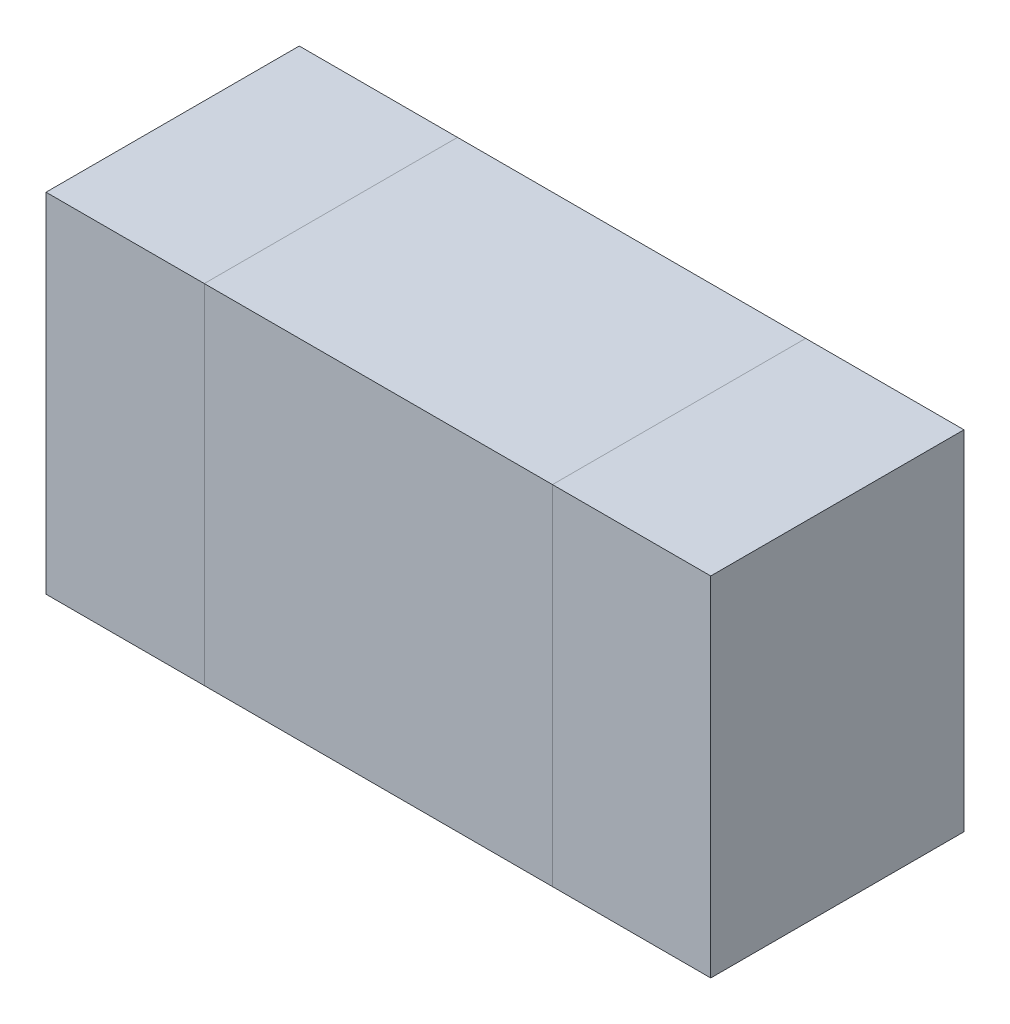
ISO-10303-21;
HEADER;
FILE_DESCRIPTION(('STEP AP214'),'2;1');
FILE_NAME('part.step','',(''),(''),'','','');
FILE_SCHEMA(('AUTOMOTIVE_DESIGN { 1 0 10303 214 1 1 1 1 }'));
ENDSEC;
DATA;
#1=APPLICATION_CONTEXT('core data for automotive mechanical design processes');
#2=APPLICATION_PROTOCOL_DEFINITION('international standard','automotive_design',2000,#1);
#3=PRODUCT_CONTEXT('',#1,'mechanical');
#4=PRODUCT('Part','Part','',(#3));
#5=PRODUCT_RELATED_PRODUCT_CATEGORY('part','',(#4));
#6=PRODUCT_DEFINITION_FORMATION('','',#4);
#7=PRODUCT_DEFINITION_CONTEXT('part definition',#1,'design');
#8=PRODUCT_DEFINITION('design','',#6,#7);
#9=PRODUCT_DEFINITION_SHAPE('','',#8);
#10=(LENGTH_UNIT() NAMED_UNIT(*) SI_UNIT(.MILLI.,.METRE.));
#11=(NAMED_UNIT(*) PLANE_ANGLE_UNIT() SI_UNIT($,.RADIAN.));
#12=(NAMED_UNIT(*) SI_UNIT($,.STERADIAN.) SOLID_ANGLE_UNIT());
#13=UNCERTAINTY_MEASURE_WITH_UNIT(LENGTH_MEASURE(1.E-05),#10,'distance_accuracy_value','');
#14=(GEOMETRIC_REPRESENTATION_CONTEXT(3) GLOBAL_UNCERTAINTY_ASSIGNED_CONTEXT((#13)) GLOBAL_UNIT_ASSIGNED_CONTEXT((#10,
#11,#12)) REPRESENTATION_CONTEXT('',''));
#15=CARTESIAN_POINT('',(0.,0.,0.));
#16=DIRECTION('',(0.,0.,1.));
#17=DIRECTION('',(1.,0.,0.));
#18=AXIS2_PLACEMENT_3D('',#15,#16,#17);
#19=CARTESIAN_POINT('',(-0.27500072,0.27500072,0.));
#20=DIRECTION('',(1.,0.,0.));
#21=DIRECTION('',(0.,-1.,0.));
#22=AXIS2_PLACEMENT_3D('',#19,#20,#21);
#23=PLANE('',#22);
#24=DIRECTION('',(0.,-1.,0.));
#25=VECTOR('',#24,1.);
#26=CARTESIAN_POINT('',(-0.27500072,0.27500072,0.));
#27=LINE('',#26,#25);
#28=CARTESIAN_POINT('',(-0.27500072,0.27500072,0.));
#29=VERTEX_POINT('',#28);
#30=CARTESIAN_POINT('',(-0.27500072,-0.27499818,0.));
#31=VERTEX_POINT('',#30);
#32=EDGE_CURVE('P0_E11',#29,#31,#27,.T.);
#33=ORIENTED_EDGE('',*,*,#32,.T.);
#34=DIRECTION('',(0.,0.,1.));
#35=VECTOR('',#34,1.);
#36=CARTESIAN_POINT('',(-0.27500072,-0.27499818,0.));
#37=LINE('',#36,#35);
#38=CARTESIAN_POINT('',(-0.27500072,-0.27499818,0.3999992));
#39=VERTEX_POINT('',#38);
#40=EDGE_CURVE('P0_E24',#31,#39,#37,.T.);
#41=ORIENTED_EDGE('',*,*,#40,.T.);
#42=DIRECTION('',(0.,-1.,0.));
#43=VECTOR('',#42,1.);
#44=CARTESIAN_POINT('',(-0.27500072,0.27500072,0.3999992));
#45=LINE('',#44,#43);
#46=CARTESIAN_POINT('',(-0.27500072,0.27500072,0.3999992));
#47=VERTEX_POINT('',#46);
#48=EDGE_CURVE('P0_E87',#47,#39,#45,.T.);
#49=ORIENTED_EDGE('',*,*,#48,.F.);
#50=DIRECTION('',(0.,0.,1.));
#51=VECTOR('',#50,1.);
#52=CARTESIAN_POINT('',(-0.27500072,0.27500072,0.));
#53=LINE('',#52,#51);
#54=EDGE_CURVE('P0_E36',#29,#47,#53,.T.);
#55=ORIENTED_EDGE('',*,*,#54,.F.);
#56=EDGE_LOOP('',(#33,#41,#49,#55));
#57=FACE_BOUND('',#56,.T.);
#58=ADVANCED_FACE('P0_F17',(#57),#23,.F.);
#59=CARTESIAN_POINT('',(-0.27500072,-0.27499818,0.));
#60=DIRECTION('',(0.,1.,0.));
#61=DIRECTION('',(1.,0.,0.));
#62=AXIS2_PLACEMENT_3D('',#59,#60,#61);
#63=PLANE('',#62);
#64=DIRECTION('',(1.,0.,0.));
#65=VECTOR('',#64,1.);
#66=CARTESIAN_POINT('',(-0.27500072,-0.27499818,0.));
#67=LINE('',#66,#65);
#68=CARTESIAN_POINT('',(0.27500072,-0.27499818,0.));
#69=VERTEX_POINT('',#68);
#70=EDGE_CURVE('P0_E84',#31,#69,#67,.T.);
#71=ORIENTED_EDGE('',*,*,#70,.T.);
#72=DIRECTION('',(0.,0.,1.));
#73=VECTOR('',#72,1.);
#74=CARTESIAN_POINT('',(0.27500072,-0.27499818,0.));
#75=LINE('',#74,#73);
#76=CARTESIAN_POINT('',(0.27500072,-0.27499818,0.3999992));
#77=VERTEX_POINT('',#76);
#78=EDGE_CURVE('P0_E82',#69,#77,#75,.T.);
#79=ORIENTED_EDGE('',*,*,#78,.T.);
#80=DIRECTION('',(1.,0.,0.));
#81=VECTOR('',#80,1.);
#82=CARTESIAN_POINT('',(-0.27500072,-0.27499818,0.3999992));
#83=LINE('',#82,#81);
#84=EDGE_CURVE('P0_E62',#39,#77,#83,.T.);
#85=ORIENTED_EDGE('',*,*,#84,.F.);
#86=ORIENTED_EDGE('',*,*,#40,.F.);
#87=EDGE_LOOP('',(#71,#79,#85,#86));
#88=FACE_BOUND('',#87,.T.);
#89=ADVANCED_FACE('P0_F89',(#88),#63,.F.);
#90=CARTESIAN_POINT('',(0.27500072,-0.27499818,0.));
#91=DIRECTION('',(-1.,0.,0.));
#92=DIRECTION('',(0.,1.,0.));
#93=AXIS2_PLACEMENT_3D('',#90,#91,#92);
#94=PLANE('',#93);
#95=DIRECTION('',(0.,1.,0.));
#96=VECTOR('',#95,1.);
#97=CARTESIAN_POINT('',(0.27500072,-0.27499818,0.));
#98=LINE('',#97,#96);
#99=CARTESIAN_POINT('',(0.27500072,0.27500072,0.));
#100=VERTEX_POINT('',#99);
#101=EDGE_CURVE('P0_E71',#69,#100,#98,.T.);
#102=ORIENTED_EDGE('',*,*,#101,.T.);
#103=DIRECTION('',(0.,0.,1.));
#104=VECTOR('',#103,1.);
#105=CARTESIAN_POINT('',(0.27500072,0.27500072,0.));
#106=LINE('',#105,#104);
#107=CARTESIAN_POINT('',(0.27500072,0.27500072,0.3999992));
#108=VERTEX_POINT('',#107);
#109=EDGE_CURVE('P0_E65',#100,#108,#106,.T.);
#110=ORIENTED_EDGE('',*,*,#109,.T.);
#111=DIRECTION('',(0.,1.,0.));
#112=VECTOR('',#111,1.);
#113=CARTESIAN_POINT('',(0.27500072,-0.27499818,0.3999992));
#114=LINE('',#113,#112);
#115=EDGE_CURVE('P0_E57',#77,#108,#114,.T.);
#116=ORIENTED_EDGE('',*,*,#115,.F.);
#117=ORIENTED_EDGE('',*,*,#78,.F.);
#118=EDGE_LOOP('',(#102,#110,#116,#117));
#119=FACE_BOUND('',#118,.T.);
#120=ADVANCED_FACE('P0_F69',(#119),#94,.F.);
#121=CARTESIAN_POINT('',(0.27500072,0.27500072,0.));
#122=DIRECTION('',(0.,-1.,0.));
#123=DIRECTION('',(-1.,0.,0.));
#124=AXIS2_PLACEMENT_3D('',#121,#122,#123);
#125=PLANE('',#124);
#126=DIRECTION('',(-1.,0.,0.));
#127=VECTOR('',#126,1.);
#128=CARTESIAN_POINT('',(0.27500072,0.27500072,0.));
#129=LINE('',#128,#127);
#130=EDGE_CURVE('P0_E66',#100,#29,#129,.T.);
#131=ORIENTED_EDGE('',*,*,#130,.T.);
#132=ORIENTED_EDGE('',*,*,#54,.T.);
#133=DIRECTION('',(-1.,0.,0.));
#134=VECTOR('',#133,1.);
#135=CARTESIAN_POINT('',(0.27500072,0.27500072,0.3999992));
#136=LINE('',#135,#134);
#137=EDGE_CURVE('P0_E61',#108,#47,#136,.T.);
#138=ORIENTED_EDGE('',*,*,#137,.F.);
#139=ORIENTED_EDGE('',*,*,#109,.F.);
#140=EDGE_LOOP('',(#131,#132,#138,#139));
#141=FACE_BOUND('',#140,.T.);
#142=ADVANCED_FACE('P0_F76',(#141),#125,.F.);
#143=CARTESIAN_POINT('',(0.,1.26999999496E-06,0.));
#144=DIRECTION('',(0.,0.,1.));
#145=DIRECTION('',(1.,0.,0.));
#146=AXIS2_PLACEMENT_3D('',#143,#144,#145);
#147=PLANE('',#146);
#148=ORIENTED_EDGE('',*,*,#130,.F.);
#149=ORIENTED_EDGE('',*,*,#101,.F.);
#150=ORIENTED_EDGE('',*,*,#70,.F.);
#151=ORIENTED_EDGE('',*,*,#32,.F.);
#152=EDGE_LOOP('',(#148,#149,#150,#151));
#153=FACE_BOUND('',#152,.T.);
#154=ADVANCED_FACE('P0_F91',(#153),#147,.F.);
#155=CARTESIAN_POINT('',(0.,1.26999999496E-06,0.3999992));
#156=DIRECTION('',(0.,0.,1.));
#157=DIRECTION('',(1.,0.,0.));
#158=AXIS2_PLACEMENT_3D('',#155,#156,#157);
#159=PLANE('',#158);
#160=ORIENTED_EDGE('',*,*,#48,.T.);
#161=ORIENTED_EDGE('',*,*,#84,.T.);
#162=ORIENTED_EDGE('',*,*,#115,.T.);
#163=ORIENTED_EDGE('',*,*,#137,.T.);
#164=EDGE_LOOP('',(#160,#161,#162,#163));
#165=FACE_BOUND('',#164,.T.);
#166=ADVANCED_FACE('P0_F59',(#165),#159,.T.);
#167=CLOSED_SHELL('',(#58,#89,#120,#142,#154,#166));
#168=MANIFOLD_SOLID_BREP('P0_B1',#167);
#169=CARTESIAN_POINT('',(-0.52499768,0.27500072,0.));
#170=DIRECTION('',(1.,0.,0.));
#171=DIRECTION('',(0.,-1.,0.));
#172=AXIS2_PLACEMENT_3D('',#169,#170,#171);
#173=PLANE('',#172);
#174=DIRECTION('',(0.,-1.,0.));
#175=VECTOR('',#174,1.);
#176=CARTESIAN_POINT('',(-0.52499768,0.27500072,0.));
#177=LINE('',#176,#175);
#178=CARTESIAN_POINT('',(-0.52499768,0.27500072,0.));
#179=VERTEX_POINT('',#178);
#180=CARTESIAN_POINT('',(-0.52499768,-0.27499818,0.));
#181=VERTEX_POINT('',#180);
#182=EDGE_CURVE('P1_E11',#179,#181,#177,.T.);
#183=ORIENTED_EDGE('',*,*,#182,.T.);
#184=DIRECTION('',(0.,0.,1.));
#185=VECTOR('',#184,1.);
#186=CARTESIAN_POINT('',(-0.52499768,-0.27499818,0.));
#187=LINE('',#186,#185);
#188=CARTESIAN_POINT('',(-0.52499768,-0.27499818,0.3999992));
#189=VERTEX_POINT('',#188);
#190=EDGE_CURVE('P1_E24',#181,#189,#187,.T.);
#191=ORIENTED_EDGE('',*,*,#190,.T.);
#192=DIRECTION('',(0.,-1.,0.));
#193=VECTOR('',#192,1.);
#194=CARTESIAN_POINT('',(-0.52499768,0.27500072,0.3999992));
#195=LINE('',#194,#193);
#196=CARTESIAN_POINT('',(-0.52499768,0.27500072,0.3999992));
#197=VERTEX_POINT('',#196);
#198=EDGE_CURVE('P1_E87',#197,#189,#195,.T.);
#199=ORIENTED_EDGE('',*,*,#198,.F.);
#200=DIRECTION('',(0.,0.,1.));
#201=VECTOR('',#200,1.);
#202=CARTESIAN_POINT('',(-0.52499768,0.27500072,0.));
#203=LINE('',#202,#201);
#204=EDGE_CURVE('P1_E36',#179,#197,#203,.T.);
#205=ORIENTED_EDGE('',*,*,#204,.F.);
#206=EDGE_LOOP('',(#183,#191,#199,#205));
#207=FACE_BOUND('',#206,.T.);
#208=ADVANCED_FACE('P1_F17',(#207),#173,.F.);
#209=CARTESIAN_POINT('',(-0.52499768,-0.27499818,0.));
#210=DIRECTION('',(0.,1.,0.));
#211=DIRECTION('',(1.,0.,0.));
#212=AXIS2_PLACEMENT_3D('',#209,#210,#211);
#213=PLANE('',#212);
#214=DIRECTION('',(1.,0.,0.));
#215=VECTOR('',#214,1.);
#216=CARTESIAN_POINT('',(-0.52499768,-0.27499818,0.));
#217=LINE('',#216,#215);
#218=CARTESIAN_POINT('',(-0.27499818,-0.27499818,0.));
#219=VERTEX_POINT('',#218);
#220=EDGE_CURVE('P1_E84',#181,#219,#217,.T.);
#221=ORIENTED_EDGE('',*,*,#220,.T.);
#222=DIRECTION('',(0.,0.,1.));
#223=VECTOR('',#222,1.);
#224=CARTESIAN_POINT('',(-0.27499818,-0.27499818,0.));
#225=LINE('',#224,#223);
#226=CARTESIAN_POINT('',(-0.27499818,-0.27499818,0.3999992));
#227=VERTEX_POINT('',#226);
#228=EDGE_CURVE('P1_E82',#219,#227,#225,.T.);
#229=ORIENTED_EDGE('',*,*,#228,.T.);
#230=DIRECTION('',(1.,0.,0.));
#231=VECTOR('',#230,1.);
#232=CARTESIAN_POINT('',(-0.52499768,-0.27499818,0.3999992));
#233=LINE('',#232,#231);
#234=EDGE_CURVE('P1_E62',#189,#227,#233,.T.);
#235=ORIENTED_EDGE('',*,*,#234,.F.);
#236=ORIENTED_EDGE('',*,*,#190,.F.);
#237=EDGE_LOOP('',(#221,#229,#235,#236));
#238=FACE_BOUND('',#237,.T.);
#239=ADVANCED_FACE('P1_F89',(#238),#213,.F.);
#240=CARTESIAN_POINT('',(-0.27499818,-0.27499818,0.));
#241=DIRECTION('',(-1.,0.,0.));
#242=DIRECTION('',(0.,1.,0.));
#243=AXIS2_PLACEMENT_3D('',#240,#241,#242);
#244=PLANE('',#243);
#245=DIRECTION('',(0.,1.,0.));
#246=VECTOR('',#245,1.);
#247=CARTESIAN_POINT('',(-0.27499818,-0.27499818,0.));
#248=LINE('',#247,#246);
#249=CARTESIAN_POINT('',(-0.27499818,0.27500072,0.));
#250=VERTEX_POINT('',#249);
#251=EDGE_CURVE('P1_E71',#219,#250,#248,.T.);
#252=ORIENTED_EDGE('',*,*,#251,.T.);
#253=DIRECTION('',(0.,0.,1.));
#254=VECTOR('',#253,1.);
#255=CARTESIAN_POINT('',(-0.27499818,0.27500072,0.));
#256=LINE('',#255,#254);
#257=CARTESIAN_POINT('',(-0.27499818,0.27500072,0.3999992));
#258=VERTEX_POINT('',#257);
#259=EDGE_CURVE('P1_E65',#250,#258,#256,.T.);
#260=ORIENTED_EDGE('',*,*,#259,.T.);
#261=DIRECTION('',(0.,1.,0.));
#262=VECTOR('',#261,1.);
#263=CARTESIAN_POINT('',(-0.27499818,-0.27499818,0.3999992));
#264=LINE('',#263,#262);
#265=EDGE_CURVE('P1_E57',#227,#258,#264,.T.);
#266=ORIENTED_EDGE('',*,*,#265,.F.);
#267=ORIENTED_EDGE('',*,*,#228,.F.);
#268=EDGE_LOOP('',(#252,#260,#266,#267));
#269=FACE_BOUND('',#268,.T.);
#270=ADVANCED_FACE('P1_F69',(#269),#244,.F.);
#271=CARTESIAN_POINT('',(-0.27499818,0.27500072,0.));
#272=DIRECTION('',(0.,-1.,0.));
#273=DIRECTION('',(-1.,0.,0.));
#274=AXIS2_PLACEMENT_3D('',#271,#272,#273);
#275=PLANE('',#274);
#276=DIRECTION('',(-1.,0.,0.));
#277=VECTOR('',#276,1.);
#278=CARTESIAN_POINT('',(-0.27499818,0.27500072,0.));
#279=LINE('',#278,#277);
#280=EDGE_CURVE('P1_E66',#250,#179,#279,.T.);
#281=ORIENTED_EDGE('',*,*,#280,.T.);
#282=ORIENTED_EDGE('',*,*,#204,.T.);
#283=DIRECTION('',(-1.,0.,0.));
#284=VECTOR('',#283,1.);
#285=CARTESIAN_POINT('',(-0.27499818,0.27500072,0.3999992));
#286=LINE('',#285,#284);
#287=EDGE_CURVE('P1_E61',#258,#197,#286,.T.);
#288=ORIENTED_EDGE('',*,*,#287,.F.);
#289=ORIENTED_EDGE('',*,*,#259,.F.);
#290=EDGE_LOOP('',(#281,#282,#288,#289));
#291=FACE_BOUND('',#290,.T.);
#292=ADVANCED_FACE('P1_F76',(#291),#275,.F.);
#293=CARTESIAN_POINT('',(-0.399997929999959,1.269999994952E-06,0.));
#294=DIRECTION('',(0.,0.,1.));
#295=DIRECTION('',(1.,0.,0.));
#296=AXIS2_PLACEMENT_3D('',#293,#294,#295);
#297=PLANE('',#296);
#298=ORIENTED_EDGE('',*,*,#280,.F.);
#299=ORIENTED_EDGE('',*,*,#251,.F.);
#300=ORIENTED_EDGE('',*,*,#220,.F.);
#301=ORIENTED_EDGE('',*,*,#182,.F.);
#302=EDGE_LOOP('',(#298,#299,#300,#301));
#303=FACE_BOUND('',#302,.T.);
#304=ADVANCED_FACE('P1_F91',(#303),#297,.F.);
#305=CARTESIAN_POINT('',(-0.399997929999959,1.269999994952E-06,0.3999992));
#306=DIRECTION('',(0.,0.,1.));
#307=DIRECTION('',(1.,0.,0.));
#308=AXIS2_PLACEMENT_3D('',#305,#306,#307);
#309=PLANE('',#308);
#310=ORIENTED_EDGE('',*,*,#198,.T.);
#311=ORIENTED_EDGE('',*,*,#234,.T.);
#312=ORIENTED_EDGE('',*,*,#265,.T.);
#313=ORIENTED_EDGE('',*,*,#287,.T.);
#314=EDGE_LOOP('',(#310,#311,#312,#313));
#315=FACE_BOUND('',#314,.T.);
#316=ADVANCED_FACE('P1_F59',(#315),#309,.T.);
#317=CLOSED_SHELL('',(#208,#239,#270,#292,#304,#316));
#318=MANIFOLD_SOLID_BREP('P1_B1',#317);
#319=CARTESIAN_POINT('',(0.27500072,0.27500072,0.));
#320=DIRECTION('',(1.,0.,0.));
#321=DIRECTION('',(0.,-1.,0.));
#322=AXIS2_PLACEMENT_3D('',#319,#320,#321);
#323=PLANE('',#322);
#324=DIRECTION('',(0.,-1.,0.));
#325=VECTOR('',#324,1.);
#326=CARTESIAN_POINT('',(0.27500072,0.27500072,0.));
#327=LINE('',#326,#325);
#328=CARTESIAN_POINT('',(0.27500072,0.27500072,0.));
#329=VERTEX_POINT('',#328);
#330=CARTESIAN_POINT('',(0.27500072,-0.27499818,0.));
#331=VERTEX_POINT('',#330);
#332=EDGE_CURVE('P2_E10',#329,#331,#327,.T.);
#333=ORIENTED_EDGE('',*,*,#332,.T.);
#334=DIRECTION('',(0.,0.,1.));
#335=VECTOR('',#334,1.);
#336=CARTESIAN_POINT('',(0.27500072,-0.27499818,0.));
#337=LINE('',#336,#335);
#338=CARTESIAN_POINT('',(0.27500072,-0.27499818,0.3999992));
#339=VERTEX_POINT('',#338);
#340=EDGE_CURVE('P2_E23',#331,#339,#337,.T.);
#341=ORIENTED_EDGE('',*,*,#340,.T.);
#342=DIRECTION('',(0.,-1.,0.));
#343=VECTOR('',#342,1.);
#344=CARTESIAN_POINT('',(0.27500072,0.27500072,0.3999992));
#345=LINE('',#344,#343);
#346=CARTESIAN_POINT('',(0.27500072,0.27500072,0.3999992));
#347=VERTEX_POINT('',#346);
#348=EDGE_CURVE('P2_E86',#347,#339,#345,.T.);
#349=ORIENTED_EDGE('',*,*,#348,.F.);
#350=DIRECTION('',(0.,0.,1.));
#351=VECTOR('',#350,1.);
#352=CARTESIAN_POINT('',(0.27500072,0.27500072,0.));
#353=LINE('',#352,#351);
#354=EDGE_CURVE('P2_E37',#329,#347,#353,.T.);
#355=ORIENTED_EDGE('',*,*,#354,.F.);
#356=EDGE_LOOP('',(#333,#341,#349,#355));
#357=FACE_BOUND('',#356,.T.);
#358=ADVANCED_FACE('P2_F16',(#357),#323,.F.);
#359=CARTESIAN_POINT('',(0.27500072,-0.27499818,0.));
#360=DIRECTION('',(0.,1.,0.));
#361=DIRECTION('',(1.,0.,0.));
#362=AXIS2_PLACEMENT_3D('',#359,#360,#361);
#363=PLANE('',#362);
#364=DIRECTION('',(1.,0.,0.));
#365=VECTOR('',#364,1.);
#366=CARTESIAN_POINT('',(0.27500072,-0.27499818,0.));
#367=LINE('',#366,#365);
#368=CARTESIAN_POINT('',(0.52500022,-0.27499818,0.));
#369=VERTEX_POINT('',#368);
#370=EDGE_CURVE('P2_E30',#331,#369,#367,.T.);
#371=ORIENTED_EDGE('',*,*,#370,.T.);
#372=DIRECTION('',(0.,0.,1.));
#373=VECTOR('',#372,1.);
#374=CARTESIAN_POINT('',(0.52500022,-0.27499818,0.));
#375=LINE('',#374,#373);
#376=CARTESIAN_POINT('',(0.52500022,-0.27499818,0.3999992));
#377=VERTEX_POINT('',#376);
#378=EDGE_CURVE('P2_E82',#369,#377,#375,.T.);
#379=ORIENTED_EDGE('',*,*,#378,.T.);
#380=DIRECTION('',(1.,0.,0.));
#381=VECTOR('',#380,1.);
#382=CARTESIAN_POINT('',(0.27500072,-0.27499818,0.3999992));
#383=LINE('',#382,#381);
#384=EDGE_CURVE('P2_E62',#339,#377,#383,.T.);
#385=ORIENTED_EDGE('',*,*,#384,.F.);
#386=ORIENTED_EDGE('',*,*,#340,.F.);
#387=EDGE_LOOP('',(#371,#379,#385,#386));
#388=FACE_BOUND('',#387,.T.);
#389=ADVANCED_FACE('P2_F89',(#388),#363,.F.);
#390=CARTESIAN_POINT('',(0.52500022,-0.27499818,0.));
#391=DIRECTION('',(-1.,0.,0.));
#392=DIRECTION('',(0.,1.,0.));
#393=AXIS2_PLACEMENT_3D('',#390,#391,#392);
#394=PLANE('',#393);
#395=DIRECTION('',(0.,1.,0.));
#396=VECTOR('',#395,1.);
#397=CARTESIAN_POINT('',(0.52500022,-0.27499818,0.));
#398=LINE('',#397,#396);
#399=CARTESIAN_POINT('',(0.52500022,0.27500072,0.));
#400=VERTEX_POINT('',#399);
#401=EDGE_CURVE('P2_E71',#369,#400,#398,.T.);
#402=ORIENTED_EDGE('',*,*,#401,.T.);
#403=DIRECTION('',(0.,0.,1.));
#404=VECTOR('',#403,1.);
#405=CARTESIAN_POINT('',(0.52500022,0.27500072,0.));
#406=LINE('',#405,#404);
#407=CARTESIAN_POINT('',(0.52500022,0.27500072,0.3999992));
#408=VERTEX_POINT('',#407);
#409=EDGE_CURVE('P2_E66',#400,#408,#406,.T.);
#410=ORIENTED_EDGE('',*,*,#409,.T.);
#411=DIRECTION('',(0.,1.,0.));
#412=VECTOR('',#411,1.);
#413=CARTESIAN_POINT('',(0.52500022,-0.27499818,0.3999992));
#414=LINE('',#413,#412);
#415=EDGE_CURVE('P2_E56',#377,#408,#414,.T.);
#416=ORIENTED_EDGE('',*,*,#415,.F.);
#417=ORIENTED_EDGE('',*,*,#378,.F.);
#418=EDGE_LOOP('',(#402,#410,#416,#417));
#419=FACE_BOUND('',#418,.T.);
#420=ADVANCED_FACE('P2_F70',(#419),#394,.F.);
#421=CARTESIAN_POINT('',(0.52500022,0.27500072,0.));
#422=DIRECTION('',(0.,-1.,0.));
#423=DIRECTION('',(-1.,0.,0.));
#424=AXIS2_PLACEMENT_3D('',#421,#422,#423);
#425=PLANE('',#424);
#426=DIRECTION('',(-1.,0.,0.));
#427=VECTOR('',#426,1.);
#428=CARTESIAN_POINT('',(0.52500022,0.27500072,0.));
#429=LINE('',#428,#427);
#430=EDGE_CURVE('P2_E67',#400,#329,#429,.T.);
#431=ORIENTED_EDGE('',*,*,#430,.T.);
#432=ORIENTED_EDGE('',*,*,#354,.T.);
#433=DIRECTION('',(-1.,0.,0.));
#434=VECTOR('',#433,1.);
#435=CARTESIAN_POINT('',(0.52500022,0.27500072,0.3999992));
#436=LINE('',#435,#434);
#437=EDGE_CURVE('P2_E60',#408,#347,#436,.T.);
#438=ORIENTED_EDGE('',*,*,#437,.F.);
#439=ORIENTED_EDGE('',*,*,#409,.F.);
#440=EDGE_LOOP('',(#431,#432,#438,#439));
#441=FACE_BOUND('',#440,.T.);
#442=ADVANCED_FACE('P2_F76',(#441),#425,.F.);
#443=CARTESIAN_POINT('',(0.400000470000041,1.269999994952E-06,0.));
#444=DIRECTION('',(0.,0.,1.));
#445=DIRECTION('',(1.,0.,0.));
#446=AXIS2_PLACEMENT_3D('',#443,#444,#445);
#447=PLANE('',#446);
#448=ORIENTED_EDGE('',*,*,#430,.F.);
#449=ORIENTED_EDGE('',*,*,#401,.F.);
#450=ORIENTED_EDGE('',*,*,#370,.F.);
#451=ORIENTED_EDGE('',*,*,#332,.F.);
#452=EDGE_LOOP('',(#448,#449,#450,#451));
#453=FACE_BOUND('',#452,.T.);
#454=ADVANCED_FACE('P2_F90',(#453),#447,.F.);
#455=CARTESIAN_POINT('',(0.400000470000041,1.269999994952E-06,0.3999992));
#456=DIRECTION('',(0.,0.,1.));
#457=DIRECTION('',(1.,0.,0.));
#458=AXIS2_PLACEMENT_3D('',#455,#456,#457);
#459=PLANE('',#458);
#460=ORIENTED_EDGE('',*,*,#348,.T.);
#461=ORIENTED_EDGE('',*,*,#384,.T.);
#462=ORIENTED_EDGE('',*,*,#415,.T.);
#463=ORIENTED_EDGE('',*,*,#437,.T.);
#464=EDGE_LOOP('',(#460,#461,#462,#463));
#465=FACE_BOUND('',#464,.T.);
#466=ADVANCED_FACE('P2_F58',(#465),#459,.T.);
#467=CLOSED_SHELL('',(#358,#389,#420,#442,#454,#466));
#468=MANIFOLD_SOLID_BREP('P2_B1',#467);
#469=ADVANCED_BREP_SHAPE_REPRESENTATION('',(#18,#168,#318,#468),#14);
#470=SHAPE_DEFINITION_REPRESENTATION(#9,#469);
ENDSEC;
END-ISO-10303-21;
